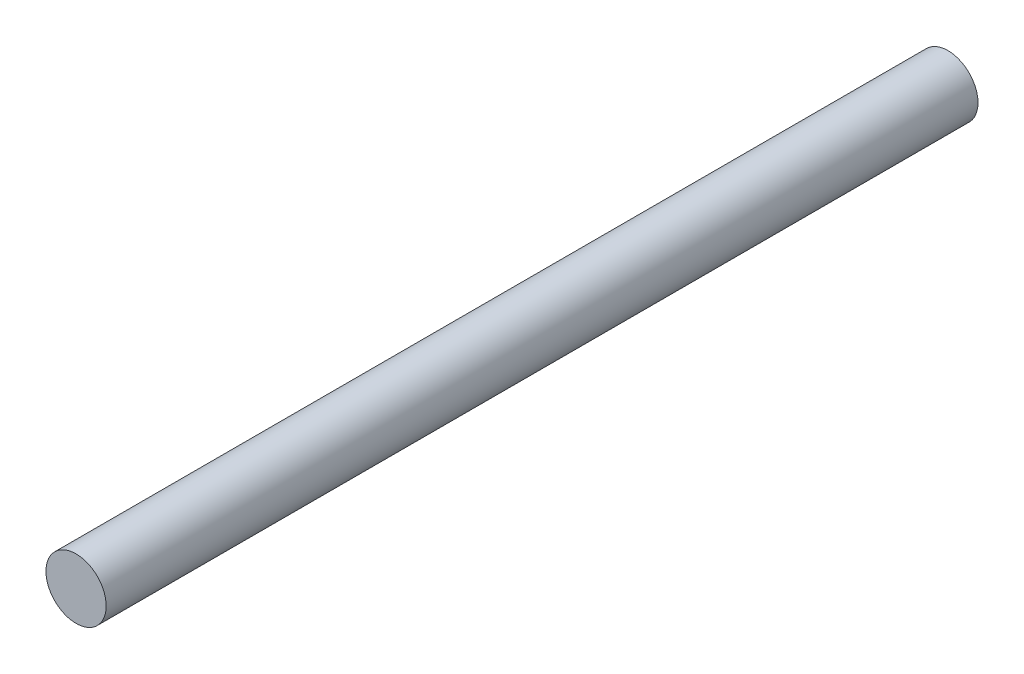
ISO-10303-21;
HEADER;
FILE_DESCRIPTION(('STEP AP214'),'2;1');
FILE_NAME('part.step','',(''),(''),'','','');
FILE_SCHEMA(('AUTOMOTIVE_DESIGN { 1 0 10303 214 1 1 1 1 }'));
ENDSEC;
DATA;
#1=APPLICATION_CONTEXT('core data for automotive mechanical design processes');
#2=APPLICATION_PROTOCOL_DEFINITION('international standard','automotive_design',2000,#1);
#3=PRODUCT_CONTEXT('',#1,'mechanical');
#4=PRODUCT('Part','Part','',(#3));
#5=PRODUCT_RELATED_PRODUCT_CATEGORY('part','',(#4));
#6=PRODUCT_DEFINITION_FORMATION('','',#4);
#7=PRODUCT_DEFINITION_CONTEXT('part definition',#1,'design');
#8=PRODUCT_DEFINITION('design','',#6,#7);
#9=PRODUCT_DEFINITION_SHAPE('','',#8);
#10=(LENGTH_UNIT() NAMED_UNIT(*) SI_UNIT(.MILLI.,.METRE.));
#11=(NAMED_UNIT(*) PLANE_ANGLE_UNIT() SI_UNIT($,.RADIAN.));
#12=(NAMED_UNIT(*) SI_UNIT($,.STERADIAN.) SOLID_ANGLE_UNIT());
#13=UNCERTAINTY_MEASURE_WITH_UNIT(LENGTH_MEASURE(1.E-05),#10,'distance_accuracy_value','');
#14=(GEOMETRIC_REPRESENTATION_CONTEXT(3) GLOBAL_UNCERTAINTY_ASSIGNED_CONTEXT((#13)) GLOBAL_UNIT_ASSIGNED_CONTEXT((#10,
#11,#12)) REPRESENTATION_CONTEXT('',''));
#15=CARTESIAN_POINT('',(0.,0.,0.));
#16=DIRECTION('',(0.,0.,1.));
#17=DIRECTION('',(1.,0.,0.));
#18=AXIS2_PLACEMENT_3D('',#15,#16,#17);
#19=CARTESIAN_POINT('',(0.,0.,110.));
#20=DIRECTION('',(0.,0.,-1.));
#21=DIRECTION('',(-1.,0.,0.));
#22=AXIS2_PLACEMENT_3D('',#19,#20,#21);
#23=CYLINDRICAL_SURFACE('',#22,3.8);
#24=CARTESIAN_POINT('',(0.,0.,110.));
#25=DIRECTION('',(0.,0.,1.));
#26=DIRECTION('',(1.,0.,0.));
#27=AXIS2_PLACEMENT_3D('',#24,#25,#26);
#28=CIRCLE('',#27,3.8);
#29=CARTESIAN_POINT('',(3.8,0.,110.));
#30=VERTEX_POINT('',#29);
#31=EDGE_CURVE('E10',#30,#30,#28,.T.);
#32=ORIENTED_EDGE('',*,*,#31,.F.);
#33=EDGE_LOOP('',(#32));
#34=FACE_BOUND('',#33,.T.);
#35=CARTESIAN_POINT('',(0.,0.,0.));
#36=DIRECTION('',(0.,0.,1.));
#37=DIRECTION('',(1.,0.,0.));
#38=AXIS2_PLACEMENT_3D('',#35,#36,#37);
#39=CIRCLE('',#38,3.8);
#40=CARTESIAN_POINT('',(3.8,0.,0.));
#41=VERTEX_POINT('',#40);
#42=EDGE_CURVE('E36',#41,#41,#39,.T.);
#43=ORIENTED_EDGE('',*,*,#42,.T.);
#44=EDGE_LOOP('',(#43));
#45=FACE_BOUND('',#44,.T.);
#46=ADVANCED_FACE('F33',(#34,#45),#23,.T.);
#47=CARTESIAN_POINT('',(0.,0.,110.));
#48=DIRECTION('',(0.,0.,1.));
#49=DIRECTION('',(1.,0.,0.));
#50=AXIS2_PLACEMENT_3D('',#47,#48,#49);
#51=PLANE('',#50);
#52=ORIENTED_EDGE('',*,*,#31,.T.);
#53=EDGE_LOOP('',(#52));
#54=FACE_BOUND('',#53,.T.);
#55=ADVANCED_FACE('F48',(#54),#51,.T.);
#56=CARTESIAN_POINT('',(0.,0.,0.));
#57=DIRECTION('',(0.,0.,1.));
#58=DIRECTION('',(1.,0.,0.));
#59=AXIS2_PLACEMENT_3D('',#56,#57,#58);
#60=PLANE('',#59);
#61=ORIENTED_EDGE('',*,*,#42,.F.);
#62=EDGE_LOOP('',(#61));
#63=FACE_BOUND('',#62,.T.);
#64=ADVANCED_FACE('F46',(#63),#60,.F.);
#65=CLOSED_SHELL('',(#46,#55,#64));
#66=MANIFOLD_SOLID_BREP('B2',#65);
#67=ADVANCED_BREP_SHAPE_REPRESENTATION('',(#18,#66),#14);
#68=SHAPE_DEFINITION_REPRESENTATION(#9,#67);
ENDSEC;
END-ISO-10303-21;
